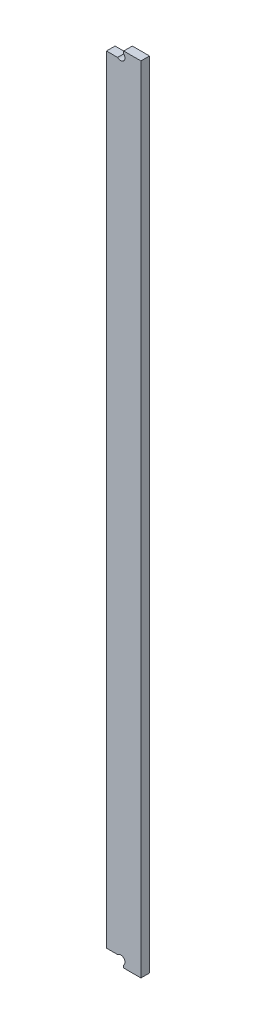
ISO-10303-21;
HEADER;
FILE_DESCRIPTION(('STEP AP214'),'2;1');
FILE_NAME('part.step','',(''),(''),'','','');
FILE_SCHEMA(('AUTOMOTIVE_DESIGN { 1 0 10303 214 1 1 1 1 }'));
ENDSEC;
DATA;
#1=APPLICATION_CONTEXT('core data for automotive mechanical design processes');
#2=APPLICATION_PROTOCOL_DEFINITION('international standard','automotive_design',2000,#1);
#3=PRODUCT_CONTEXT('',#1,'mechanical');
#4=PRODUCT('Part','Part','',(#3));
#5=PRODUCT_RELATED_PRODUCT_CATEGORY('part','',(#4));
#6=PRODUCT_DEFINITION_FORMATION('','',#4);
#7=PRODUCT_DEFINITION_CONTEXT('part definition',#1,'design');
#8=PRODUCT_DEFINITION('design','',#6,#7);
#9=PRODUCT_DEFINITION_SHAPE('','',#8);
#10=(LENGTH_UNIT() NAMED_UNIT(*) SI_UNIT(.MILLI.,.METRE.));
#11=(NAMED_UNIT(*) PLANE_ANGLE_UNIT() SI_UNIT($,.RADIAN.));
#12=(NAMED_UNIT(*) SI_UNIT($,.STERADIAN.) SOLID_ANGLE_UNIT());
#13=UNCERTAINTY_MEASURE_WITH_UNIT(LENGTH_MEASURE(1.E-05),#10,'distance_accuracy_value','');
#14=(GEOMETRIC_REPRESENTATION_CONTEXT(3) GLOBAL_UNCERTAINTY_ASSIGNED_CONTEXT((#13)) GLOBAL_UNIT_ASSIGNED_CONTEXT((#10,
#11,#12)) REPRESENTATION_CONTEXT('',''));
#15=CARTESIAN_POINT('',(0.,0.,0.));
#16=DIRECTION('',(0.,0.,1.));
#17=DIRECTION('',(1.,0.,0.));
#18=AXIS2_PLACEMENT_3D('',#15,#16,#17);
#19=CARTESIAN_POINT('',(39.6875,-1.58750000000002,3.175));
#20=DIRECTION('',(-1.,0.,0.));
#21=DIRECTION('',(0.,0.,1.));
#22=AXIS2_PLACEMENT_3D('',#19,#20,#21);
#23=PLANE('',#22);
#24=DIRECTION('',(0.,1.,0.));
#25=VECTOR('',#24,1.);
#26=CARTESIAN_POINT('',(39.6875,-1.58750000000002,0.));
#27=LINE('',#26,#25);
#28=CARTESIAN_POINT('',(39.6875,-1.58750000000002,0.));
#29=VERTEX_POINT('',#28);
#30=CARTESIAN_POINT('',(39.6875,291.062500032,0.));
#31=VERTEX_POINT('',#30);
#32=EDGE_CURVE('E136',#29,#31,#27,.T.);
#33=ORIENTED_EDGE('',*,*,#32,.T.);
#34=DIRECTION('',(0.,0.,-1.));
#35=VECTOR('',#34,1.);
#36=CARTESIAN_POINT('',(39.6875,291.062500032,3.175));
#37=LINE('',#36,#35);
#38=CARTESIAN_POINT('',(39.6875,291.062500032,3.175));
#39=VERTEX_POINT('',#38);
#40=EDGE_CURVE('E160',#39,#31,#37,.T.);
#41=ORIENTED_EDGE('',*,*,#40,.F.);
#42=DIRECTION('',(0.,1.,0.));
#43=VECTOR('',#42,1.);
#44=CARTESIAN_POINT('',(39.6875,-1.58750000000002,3.175));
#45=LINE('',#44,#43);
#46=CARTESIAN_POINT('',(39.6875,-1.58750000000002,3.175));
#47=VERTEX_POINT('',#46);
#48=EDGE_CURVE('E153',#47,#39,#45,.T.);
#49=ORIENTED_EDGE('',*,*,#48,.F.);
#50=DIRECTION('',(0.,0.,-1.));
#51=VECTOR('',#50,1.);
#52=CARTESIAN_POINT('',(39.6875,-1.58750000000002,3.175));
#53=LINE('',#52,#51);
#54=EDGE_CURVE('E135',#47,#29,#53,.T.);
#55=ORIENTED_EDGE('',*,*,#54,.T.);
#56=EDGE_LOOP('',(#33,#41,#49,#55));
#57=FACE_BOUND('',#56,.T.);
#58=ADVANCED_FACE('F33',(#57),#23,.F.);
#59=CARTESIAN_POINT('',(39.6875,291.062500032,3.175));
#60=DIRECTION('',(0.,-1.,0.));
#61=DIRECTION('',(0.,0.,-1.));
#62=AXIS2_PLACEMENT_3D('',#59,#60,#61);
#63=PLANE('',#62);
#64=DIRECTION('',(-1.,0.,0.));
#65=VECTOR('',#64,1.);
#66=CARTESIAN_POINT('',(39.6875,291.062500032,0.));
#67=LINE('',#66,#65);
#68=CARTESIAN_POINT('',(33.3375,291.062500032,0.));
#69=VERTEX_POINT('',#68);
#70=EDGE_CURVE('E139',#31,#69,#67,.T.);
#71=ORIENTED_EDGE('',*,*,#70,.T.);
#72=DIRECTION('',(0.,0.,-1.));
#73=VECTOR('',#72,1.);
#74=CARTESIAN_POINT('',(33.3375,291.062500032,3.175));
#75=LINE('',#74,#73);
#76=CARTESIAN_POINT('',(33.3375,291.062500032,3.175));
#77=VERTEX_POINT('',#76);
#78=EDGE_CURVE('E157',#77,#69,#75,.T.);
#79=ORIENTED_EDGE('',*,*,#78,.F.);
#80=DIRECTION('',(-1.,0.,0.));
#81=VECTOR('',#80,1.);
#82=CARTESIAN_POINT('',(39.6875,291.062500032,3.175));
#83=LINE('',#82,#81);
#84=EDGE_CURVE('E90',#39,#77,#83,.T.);
#85=ORIENTED_EDGE('',*,*,#84,.F.);
#86=ORIENTED_EDGE('',*,*,#40,.T.);
#87=EDGE_LOOP('',(#71,#79,#85,#86));
#88=FACE_BOUND('',#87,.T.);
#89=ADVANCED_FACE('F210',(#88),#63,.F.);
#90=CARTESIAN_POINT('',(33.3375,291.062500032,3.175));
#91=DIRECTION('',(1.,0.,0.));
#92=DIRECTION('',(0.,0.,-1.));
#93=AXIS2_PLACEMENT_3D('',#90,#91,#92);
#94=PLANE('',#93);
#95=DIRECTION('',(0.,-1.,0.));
#96=VECTOR('',#95,1.);
#97=CARTESIAN_POINT('',(33.3375,291.062500032,0.));
#98=LINE('',#97,#96);
#99=CARTESIAN_POINT('',(33.3375,290.132564062267,0.));
#100=VERTEX_POINT('',#99);
#101=EDGE_CURVE('E142',#69,#100,#98,.T.);
#102=ORIENTED_EDGE('',*,*,#101,.T.);
#103=DIRECTION('',(0.,0.,-1.));
#104=VECTOR('',#103,1.);
#105=CARTESIAN_POINT('',(33.3375,290.132564062267,7.6651280605346));
#106=LINE('',#105,#104);
#107=CARTESIAN_POINT('',(33.3375,290.132564062267,3.175));
#108=VERTEX_POINT('',#107);
#109=EDGE_CURVE('E140',#100,#108,#106,.F.);
#110=ORIENTED_EDGE('',*,*,#109,.T.);
#111=DIRECTION('',(0.,-1.,0.));
#112=VECTOR('',#111,1.);
#113=CARTESIAN_POINT('',(33.3375,291.062500032,3.175));
#114=LINE('',#113,#112);
#115=EDGE_CURVE('E188',#77,#108,#114,.T.);
#116=ORIENTED_EDGE('',*,*,#115,.F.);
#117=ORIENTED_EDGE('',*,*,#78,.T.);
#118=EDGE_LOOP('',(#102,#110,#116,#117));
#119=FACE_BOUND('',#118,.T.);
#120=ADVANCED_FACE('F195',(#119),#94,.F.);
#121=CARTESIAN_POINT('',(33.3375,287.887500032,3.175));
#122=DIRECTION('',(0.,-1.,0.));
#123=DIRECTION('',(0.,0.,-1.));
#124=AXIS2_PLACEMENT_3D('',#121,#122,#123);
#125=PLANE('',#124);
#126=DIRECTION('',(-1.,0.,0.));
#127=VECTOR('',#126,1.);
#128=CARTESIAN_POINT('',(33.3375,287.887500032,3.175));
#129=LINE('',#128,#127);
#130=CARTESIAN_POINT('',(31.0924359697327,287.887500032,3.175));
#131=VERTEX_POINT('',#130);
#132=CARTESIAN_POINT('',(26.9875000000001,287.887500032,3.175));
#133=VERTEX_POINT('',#132);
#134=EDGE_CURVE('E109',#131,#133,#129,.T.);
#135=ORIENTED_EDGE('',*,*,#134,.F.);
#136=DIRECTION('',(0.,0.,-1.));
#137=VECTOR('',#136,1.);
#138=CARTESIAN_POINT('',(31.0924359697327,287.887500032,7.6651280605346));
#139=LINE('',#138,#137);
#140=CARTESIAN_POINT('',(31.0924359697327,287.887500032,0.));
#141=VERTEX_POINT('',#140);
#142=EDGE_CURVE('E175',#131,#141,#139,.T.);
#143=ORIENTED_EDGE('',*,*,#142,.T.);
#144=DIRECTION('',(-1.,0.,0.));
#145=VECTOR('',#144,1.);
#146=CARTESIAN_POINT('',(33.3375,287.887500032,0.));
#147=LINE('',#146,#145);
#148=CARTESIAN_POINT('',(26.9875000000001,287.887500032,0.));
#149=VERTEX_POINT('',#148);
#150=EDGE_CURVE('E145',#141,#149,#147,.T.);
#151=ORIENTED_EDGE('',*,*,#150,.T.);
#152=DIRECTION('',(0.,0.,-1.));
#153=VECTOR('',#152,1.);
#154=CARTESIAN_POINT('',(26.9875000000001,287.887500032,3.175));
#155=LINE('',#154,#153);
#156=EDGE_CURVE('E122',#133,#149,#155,.T.);
#157=ORIENTED_EDGE('',*,*,#156,.F.);
#158=EDGE_LOOP('',(#135,#143,#151,#157));
#159=FACE_BOUND('',#158,.T.);
#160=ADVANCED_FACE('F216',(#159),#125,.F.);
#161=CARTESIAN_POINT('',(26.9875000000001,287.887500032,3.175));
#162=DIRECTION('',(1.,0.,0.));
#163=DIRECTION('',(0.,0.,-1.));
#164=AXIS2_PLACEMENT_3D('',#161,#162,#163);
#165=PLANE('',#164);
#166=DIRECTION('',(0.,-1.,0.));
#167=VECTOR('',#166,1.);
#168=CARTESIAN_POINT('',(26.9875000000001,287.887500032,0.));
#169=LINE('',#168,#167);
#170=CARTESIAN_POINT('',(26.9875000000001,1.58750000000002,0.));
#171=VERTEX_POINT('',#170);
#172=EDGE_CURVE('E118',#149,#171,#169,.T.);
#173=ORIENTED_EDGE('',*,*,#172,.T.);
#174=DIRECTION('',(0.,0.,-1.));
#175=VECTOR('',#174,1.);
#176=CARTESIAN_POINT('',(26.9875000000001,1.58750000000002,3.175));
#177=LINE('',#176,#175);
#178=CARTESIAN_POINT('',(26.9875000000001,1.58750000000002,3.175));
#179=VERTEX_POINT('',#178);
#180=EDGE_CURVE('E115',#179,#171,#177,.T.);
#181=ORIENTED_EDGE('',*,*,#180,.F.);
#182=DIRECTION('',(0.,-1.,0.));
#183=VECTOR('',#182,1.);
#184=CARTESIAN_POINT('',(26.9875000000001,287.887500032,3.175));
#185=LINE('',#184,#183);
#186=EDGE_CURVE('E100',#133,#179,#185,.T.);
#187=ORIENTED_EDGE('',*,*,#186,.F.);
#188=ORIENTED_EDGE('',*,*,#156,.T.);
#189=EDGE_LOOP('',(#173,#181,#187,#188));
#190=FACE_BOUND('',#189,.T.);
#191=ADVANCED_FACE('F116',(#190),#165,.F.);
#192=CARTESIAN_POINT('',(33.3375,1.58750000000002,3.175));
#193=DIRECTION('',(0.,1.,0.));
#194=DIRECTION('',(0.,0.,1.));
#195=AXIS2_PLACEMENT_3D('',#192,#193,#194);
#196=PLANE('',#195);
#197=DIRECTION('',(1.,0.,0.));
#198=VECTOR('',#197,1.);
#199=CARTESIAN_POINT('',(33.3375,1.58750000000002,0.));
#200=LINE('',#199,#198);
#201=CARTESIAN_POINT('',(31.0924359697327,1.58750000000002,0.));
#202=VERTEX_POINT('',#201);
#203=EDGE_CURVE('E148',#171,#202,#200,.T.);
#204=ORIENTED_EDGE('',*,*,#203,.T.);
#205=DIRECTION('',(0.,0.,-1.));
#206=VECTOR('',#205,1.);
#207=CARTESIAN_POINT('',(31.0924359697327,1.58750000000002,7.6651280605346));
#208=LINE('',#207,#206);
#209=CARTESIAN_POINT('',(31.0924359697327,1.58750000000002,3.175));
#210=VERTEX_POINT('',#209);
#211=EDGE_CURVE('E128',#202,#210,#208,.F.);
#212=ORIENTED_EDGE('',*,*,#211,.T.);
#213=DIRECTION('',(1.,0.,0.));
#214=VECTOR('',#213,1.);
#215=CARTESIAN_POINT('',(33.3375,1.58750000000002,3.175));
#216=LINE('',#215,#214);
#217=EDGE_CURVE('E107',#179,#210,#216,.T.);
#218=ORIENTED_EDGE('',*,*,#217,.F.);
#219=ORIENTED_EDGE('',*,*,#180,.T.);
#220=EDGE_LOOP('',(#204,#212,#218,#219));
#221=FACE_BOUND('',#220,.T.);
#222=ADVANCED_FACE('F126',(#221),#196,.F.);
#223=CARTESIAN_POINT('',(33.3375,-1.58750000000002,3.175));
#224=DIRECTION('',(1.,0.,0.));
#225=DIRECTION('',(0.,0.,-1.));
#226=AXIS2_PLACEMENT_3D('',#223,#224,#225);
#227=PLANE('',#226);
#228=DIRECTION('',(0.,-1.,0.));
#229=VECTOR('',#228,1.);
#230=CARTESIAN_POINT('',(33.3375,-1.58750000000002,3.175));
#231=LINE('',#230,#229);
#232=CARTESIAN_POINT('',(33.3375,-0.657564030267302,3.175));
#233=VERTEX_POINT('',#232);
#234=CARTESIAN_POINT('',(33.3375,-1.58750000000002,3.175));
#235=VERTEX_POINT('',#234);
#236=EDGE_CURVE('E129',#233,#235,#231,.T.);
#237=ORIENTED_EDGE('',*,*,#236,.F.);
#238=DIRECTION('',(0.,0.,-1.));
#239=VECTOR('',#238,1.);
#240=CARTESIAN_POINT('',(33.3375,-0.657564030267302,7.6651280605346));
#241=LINE('',#240,#239);
#242=CARTESIAN_POINT('',(33.3375,-0.657564030267302,0.));
#243=VERTEX_POINT('',#242);
#244=EDGE_CURVE('E176',#233,#243,#241,.T.);
#245=ORIENTED_EDGE('',*,*,#244,.T.);
#246=DIRECTION('',(0.,-1.,0.));
#247=VECTOR('',#246,1.);
#248=CARTESIAN_POINT('',(33.3375,-1.58750000000002,0.));
#249=LINE('',#248,#247);
#250=CARTESIAN_POINT('',(33.3375,-1.58750000000002,0.));
#251=VERTEX_POINT('',#250);
#252=EDGE_CURVE('E150',#243,#251,#249,.T.);
#253=ORIENTED_EDGE('',*,*,#252,.T.);
#254=DIRECTION('',(0.,0.,-1.));
#255=VECTOR('',#254,1.);
#256=CARTESIAN_POINT('',(33.3375,-1.58750000000002,3.175));
#257=LINE('',#256,#255);
#258=EDGE_CURVE('E123',#235,#251,#257,.T.);
#259=ORIENTED_EDGE('',*,*,#258,.F.);
#260=EDGE_LOOP('',(#237,#245,#253,#259));
#261=FACE_BOUND('',#260,.T.);
#262=ADVANCED_FACE('F204',(#261),#227,.F.);
#263=CARTESIAN_POINT('',(39.6875,-1.58750000000002,3.175));
#264=DIRECTION('',(0.,1.,0.));
#265=DIRECTION('',(0.,0.,1.));
#266=AXIS2_PLACEMENT_3D('',#263,#264,#265);
#267=PLANE('',#266);
#268=DIRECTION('',(1.,0.,0.));
#269=VECTOR('',#268,1.);
#270=CARTESIAN_POINT('',(39.6875,-1.58750000000002,0.));
#271=LINE('',#270,#269);
#272=EDGE_CURVE('E81',#251,#29,#271,.T.);
#273=ORIENTED_EDGE('',*,*,#272,.T.);
#274=ORIENTED_EDGE('',*,*,#54,.F.);
#275=DIRECTION('',(1.,0.,0.));
#276=VECTOR('',#275,1.);
#277=CARTESIAN_POINT('',(39.6875,-1.58750000000002,3.175));
#278=LINE('',#277,#276);
#279=EDGE_CURVE('E54',#235,#47,#278,.T.);
#280=ORIENTED_EDGE('',*,*,#279,.F.);
#281=ORIENTED_EDGE('',*,*,#258,.T.);
#282=EDGE_LOOP('',(#273,#274,#280,#281));
#283=FACE_BOUND('',#282,.T.);
#284=ADVANCED_FACE('F205',(#283),#267,.F.);
#285=CARTESIAN_POINT('',(0.,0.,3.175));
#286=DIRECTION('',(0.,0.,1.));
#287=DIRECTION('',(1.,0.,0.));
#288=AXIS2_PLACEMENT_3D('',#285,#286,#287);
#289=PLANE('',#288);
#290=CARTESIAN_POINT('',(32.2149679848663,289.010032047134,3.175));
#291=DIRECTION('',(0.,0.,1.));
#292=DIRECTION('',(1.,0.,0.));
#293=AXIS2_PLACEMENT_3D('',#290,#291,#292);
#294=CIRCLE('',#293,1.5875);
#295=EDGE_CURVE('E180',#108,#131,#294,.F.);
#296=ORIENTED_EDGE('',*,*,#295,.T.);
#297=ORIENTED_EDGE('',*,*,#134,.T.);
#298=ORIENTED_EDGE('',*,*,#186,.T.);
#299=ORIENTED_EDGE('',*,*,#217,.T.);
#300=CARTESIAN_POINT('',(32.2149679848663,0.464967984866338,3.175));
#301=DIRECTION('',(0.,0.,1.));
#302=DIRECTION('',(1.,0.,0.));
#303=AXIS2_PLACEMENT_3D('',#300,#301,#302);
#304=CIRCLE('',#303,1.5875);
#305=EDGE_CURVE('E174',#210,#233,#304,.F.);
#306=ORIENTED_EDGE('',*,*,#305,.T.);
#307=ORIENTED_EDGE('',*,*,#236,.T.);
#308=ORIENTED_EDGE('',*,*,#279,.T.);
#309=ORIENTED_EDGE('',*,*,#48,.T.);
#310=ORIENTED_EDGE('',*,*,#84,.T.);
#311=ORIENTED_EDGE('',*,*,#115,.T.);
#312=EDGE_LOOP('',(#296,#297,#298,#299,#306,#307,#308,#309,#310,#311));
#313=FACE_BOUND('',#312,.T.);
#314=ADVANCED_FACE('F103',(#313),#289,.T.);
#315=CARTESIAN_POINT('',(0.,0.,0.));
#316=DIRECTION('',(0.,0.,1.));
#317=DIRECTION('',(1.,0.,0.));
#318=AXIS2_PLACEMENT_3D('',#315,#316,#317);
#319=PLANE('',#318);
#320=ORIENTED_EDGE('',*,*,#150,.F.);
#321=CARTESIAN_POINT('',(32.2149679848663,289.010032047134,0.));
#322=DIRECTION('',(0.,0.,1.));
#323=DIRECTION('',(1.,0.,0.));
#324=AXIS2_PLACEMENT_3D('',#321,#322,#323);
#325=CIRCLE('',#324,1.5875);
#326=EDGE_CURVE('E11',#141,#100,#325,.T.);
#327=ORIENTED_EDGE('',*,*,#326,.T.);
#328=ORIENTED_EDGE('',*,*,#101,.F.);
#329=ORIENTED_EDGE('',*,*,#70,.F.);
#330=ORIENTED_EDGE('',*,*,#32,.F.);
#331=ORIENTED_EDGE('',*,*,#272,.F.);
#332=ORIENTED_EDGE('',*,*,#252,.F.);
#333=CARTESIAN_POINT('',(32.2149679848663,0.464967984866338,0.));
#334=DIRECTION('',(0.,0.,1.));
#335=DIRECTION('',(1.,0.,0.));
#336=AXIS2_PLACEMENT_3D('',#333,#334,#335);
#337=CIRCLE('',#336,1.5875);
#338=EDGE_CURVE('E40',#243,#202,#337,.T.);
#339=ORIENTED_EDGE('',*,*,#338,.T.);
#340=ORIENTED_EDGE('',*,*,#203,.F.);
#341=ORIENTED_EDGE('',*,*,#172,.F.);
#342=EDGE_LOOP('',(#320,#327,#328,#329,#330,#331,#332,#339,#340,#341));
#343=FACE_BOUND('',#342,.T.);
#344=ADVANCED_FACE('F165',(#343),#319,.F.);
#345=CARTESIAN_POINT('',(32.2149679848663,0.464967984866338,7.6651280605346));
#346=DIRECTION('',(0.,0.,-1.));
#347=DIRECTION('',(-1.,0.,0.));
#348=AXIS2_PLACEMENT_3D('',#345,#346,#347);
#349=CYLINDRICAL_SURFACE('',#348,1.5875);
#350=ORIENTED_EDGE('',*,*,#211,.F.);
#351=ORIENTED_EDGE('',*,*,#338,.F.);
#352=ORIENTED_EDGE('',*,*,#244,.F.);
#353=ORIENTED_EDGE('',*,*,#305,.F.);
#354=EDGE_LOOP('',(#350,#351,#352,#353));
#355=FACE_BOUND('',#354,.T.);
#356=ADVANCED_FACE('F173',(#355),#349,.F.);
#357=CARTESIAN_POINT('',(32.2149679848663,289.010032047134,7.6651280605346));
#358=DIRECTION('',(0.,0.,-1.));
#359=DIRECTION('',(-1.,0.,0.));
#360=AXIS2_PLACEMENT_3D('',#357,#358,#359);
#361=CYLINDRICAL_SURFACE('',#360,1.5875);
#362=ORIENTED_EDGE('',*,*,#109,.F.);
#363=ORIENTED_EDGE('',*,*,#326,.F.);
#364=ORIENTED_EDGE('',*,*,#142,.F.);
#365=ORIENTED_EDGE('',*,*,#295,.F.);
#366=EDGE_LOOP('',(#362,#363,#364,#365));
#367=FACE_BOUND('',#366,.T.);
#368=ADVANCED_FACE('F197',(#367),#361,.F.);
#369=CLOSED_SHELL('',(#58,#89,#120,#160,#191,#222,#262,#284,#314,#344,#356,#368));
#370=MANIFOLD_SOLID_BREP('B2',#369);
#371=ADVANCED_BREP_SHAPE_REPRESENTATION('',(#18,#370),#14);
#372=SHAPE_DEFINITION_REPRESENTATION(#9,#371);
ENDSEC;
END-ISO-10303-21;
